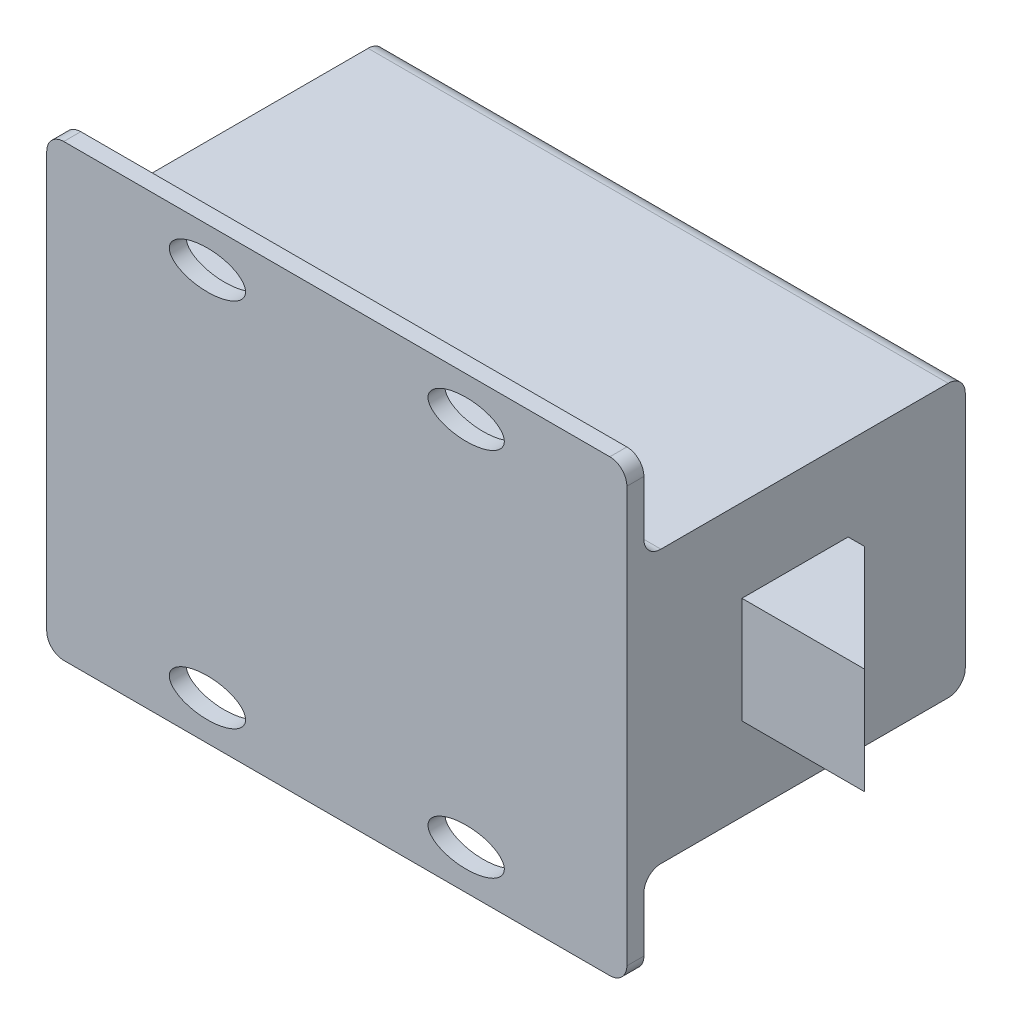
ISO-10303-21;
HEADER;
FILE_DESCRIPTION(('STEP AP214'),'2;1');
FILE_NAME('part.step','',(''),(''),'','','');
FILE_SCHEMA(('AUTOMOTIVE_DESIGN { 1 0 10303 214 1 1 1 1 }'));
ENDSEC;
DATA;
#1=APPLICATION_CONTEXT('core data for automotive mechanical design processes');
#2=APPLICATION_PROTOCOL_DEFINITION('international standard','automotive_design',2000,#1);
#3=PRODUCT_CONTEXT('',#1,'mechanical');
#4=PRODUCT('Part','Part','',(#3));
#5=PRODUCT_RELATED_PRODUCT_CATEGORY('part','',(#4));
#6=PRODUCT_DEFINITION_FORMATION('','',#4);
#7=PRODUCT_DEFINITION_CONTEXT('part definition',#1,'design');
#8=PRODUCT_DEFINITION('design','',#6,#7);
#9=PRODUCT_DEFINITION_SHAPE('','',#8);
#10=(LENGTH_UNIT() NAMED_UNIT(*) SI_UNIT(.MILLI.,.METRE.));
#11=(NAMED_UNIT(*) PLANE_ANGLE_UNIT() SI_UNIT($,.RADIAN.));
#12=(NAMED_UNIT(*) SI_UNIT($,.STERADIAN.) SOLID_ANGLE_UNIT());
#13=UNCERTAINTY_MEASURE_WITH_UNIT(LENGTH_MEASURE(1.E-05),#10,'distance_accuracy_value','');
#14=(GEOMETRIC_REPRESENTATION_CONTEXT(3) GLOBAL_UNCERTAINTY_ASSIGNED_CONTEXT((#13)) GLOBAL_UNIT_ASSIGNED_CONTEXT((#10,
#11,#12)) REPRESENTATION_CONTEXT('',''));
#15=CARTESIAN_POINT('',(0.,0.,0.));
#16=DIRECTION('',(0.,0.,1.));
#17=DIRECTION('',(1.,0.,0.));
#18=AXIS2_PLACEMENT_3D('',#15,#16,#17);
#19=CARTESIAN_POINT('',(27.051,-20.955,1.5875));
#20=DIRECTION('',(-1.,0.,0.));
#21=DIRECTION('',(0.,0.,1.));
#22=AXIS2_PLACEMENT_3D('',#19,#20,#21);
#23=PLANE('',#22);
#24=DIRECTION('',(0.,0.,1.));
#25=VECTOR('',#24,1.);
#26=CARTESIAN_POINT('',(27.051,-12.7,-29.972));
#27=LINE('',#26,#25);
#28=CARTESIAN_POINT('',(27.051,-12.7,-28.3845));
#29=VERTEX_POINT('',#28);
#30=CARTESIAN_POINT('',(27.051,-12.7,-1.5875));
#31=VERTEX_POINT('',#30);
#32=EDGE_CURVE('E421',#29,#31,#27,.T.);
#33=ORIENTED_EDGE('',*,*,#32,.F.);
#34=CARTESIAN_POINT('',(27.051,-11.1125,-28.3845));
#35=DIRECTION('',(-1.,0.,0.));
#36=DIRECTION('',(0.,0.,1.));
#37=AXIS2_PLACEMENT_3D('',#34,#35,#36);
#38=CIRCLE('',#37,1.5875);
#39=CARTESIAN_POINT('',(27.051,-11.1125,-29.972));
#40=VERTEX_POINT('',#39);
#41=EDGE_CURVE('E42',#29,#40,#38,.F.);
#42=ORIENTED_EDGE('',*,*,#41,.T.);
#43=DIRECTION('',(0.,-1.,0.));
#44=VECTOR('',#43,1.);
#45=CARTESIAN_POINT('',(27.051,-12.7,-29.972));
#46=LINE('',#45,#44);
#47=CARTESIAN_POINT('',(27.051,11.1125,-29.972));
#48=VERTEX_POINT('',#47);
#49=EDGE_CURVE('E425',#48,#40,#46,.T.);
#50=ORIENTED_EDGE('',*,*,#49,.F.);
#51=CARTESIAN_POINT('',(27.051,11.1125,-28.3845));
#52=DIRECTION('',(-1.,0.,0.));
#53=DIRECTION('',(0.,0.,1.));
#54=AXIS2_PLACEMENT_3D('',#51,#52,#53);
#55=CIRCLE('',#54,1.5875);
#56=CARTESIAN_POINT('',(27.051,12.7,-28.3845));
#57=VERTEX_POINT('',#56);
#58=EDGE_CURVE('E321',#48,#57,#55,.F.);
#59=ORIENTED_EDGE('',*,*,#58,.T.);
#60=DIRECTION('',(0.,0.,1.));
#61=VECTOR('',#60,1.);
#62=CARTESIAN_POINT('',(27.051,12.7,-29.972));
#63=LINE('',#62,#61);
#64=CARTESIAN_POINT('',(27.051,12.7,-1.5875));
#65=VERTEX_POINT('',#64);
#66=EDGE_CURVE('E419',#57,#65,#63,.T.);
#67=ORIENTED_EDGE('',*,*,#66,.T.);
#68=CARTESIAN_POINT('',(27.051,14.2875,-1.5875));
#69=DIRECTION('',(-1.,0.,0.));
#70=DIRECTION('',(0.,0.,1.));
#71=AXIS2_PLACEMENT_3D('',#68,#69,#70);
#72=CIRCLE('',#71,1.5875);
#73=CARTESIAN_POINT('',(27.051,14.2875,0.));
#74=VERTEX_POINT('',#73);
#75=EDGE_CURVE('E336',#65,#74,#72,.T.);
#76=ORIENTED_EDGE('',*,*,#75,.T.);
#77=DIRECTION('',(0.,1.,0.));
#78=VECTOR('',#77,1.);
#79=CARTESIAN_POINT('',(27.051,-20.955,0.));
#80=LINE('',#79,#78);
#81=CARTESIAN_POINT('',(27.051,19.3675,0.));
#82=VERTEX_POINT('',#81);
#83=EDGE_CURVE('E406',#74,#82,#80,.T.);
#84=ORIENTED_EDGE('',*,*,#83,.T.);
#85=DIRECTION('',(0.,0.,-1.));
#86=VECTOR('',#85,1.);
#87=CARTESIAN_POINT('',(27.051,19.3675,1.5875));
#88=LINE('',#87,#86);
#89=CARTESIAN_POINT('',(27.051,19.3675,1.5875));
#90=VERTEX_POINT('',#89);
#91=EDGE_CURVE('E389',#82,#90,#88,.F.);
#92=ORIENTED_EDGE('',*,*,#91,.T.);
#93=DIRECTION('',(0.,1.,0.));
#94=VECTOR('',#93,1.);
#95=CARTESIAN_POINT('',(27.051,-20.955,1.5875));
#96=LINE('',#95,#94);
#97=CARTESIAN_POINT('',(27.051,-19.3675,1.5875));
#98=VERTEX_POINT('',#97);
#99=EDGE_CURVE('E395',#98,#90,#96,.T.);
#100=ORIENTED_EDGE('',*,*,#99,.F.);
#101=DIRECTION('',(0.,0.,-1.));
#102=VECTOR('',#101,1.);
#103=CARTESIAN_POINT('',(27.051,-19.3675,1.5875));
#104=LINE('',#103,#102);
#105=CARTESIAN_POINT('',(27.051,-19.3675,0.));
#106=VERTEX_POINT('',#105);
#107=EDGE_CURVE('E386',#98,#106,#104,.T.);
#108=ORIENTED_EDGE('',*,*,#107,.T.);
#109=CARTESIAN_POINT('',(27.051,-14.2875,0.));
#110=VERTEX_POINT('',#109);
#111=EDGE_CURVE('E403',#106,#110,#80,.T.);
#112=ORIENTED_EDGE('',*,*,#111,.T.);
#113=CARTESIAN_POINT('',(27.051,-14.2875,-1.5875));
#114=DIRECTION('',(-1.,0.,0.));
#115=DIRECTION('',(0.,0.,1.));
#116=AXIS2_PLACEMENT_3D('',#113,#114,#115);
#117=CIRCLE('',#116,1.5875);
#118=EDGE_CURVE('E338',#110,#31,#117,.T.);
#119=ORIENTED_EDGE('',*,*,#118,.T.);
#120=EDGE_LOOP('',(#33,#42,#50,#59,#67,#76,#84,#92,#100,#108,#112,#119));
#121=FACE_BOUND('',#120,.T.);
#122=DIRECTION('',(0.,0.,1.));
#123=VECTOR('',#122,1.);
#124=CARTESIAN_POINT('',(27.051,4.953,-19.05));
#125=LINE('',#124,#123);
#126=CARTESIAN_POINT('',(27.051,4.953,-19.05));
#127=VERTEX_POINT('',#126);
#128=CARTESIAN_POINT('',(27.051,4.953,-9.144));
#129=VERTEX_POINT('',#128);
#130=EDGE_CURVE('E628',#127,#129,#125,.T.);
#131=ORIENTED_EDGE('',*,*,#130,.F.);
#132=DIRECTION('',(0.,1.,0.));
#133=VECTOR('',#132,1.);
#134=CARTESIAN_POINT('',(27.051,-4.953,-19.05));
#135=LINE('',#134,#133);
#136=CARTESIAN_POINT('',(27.051,-4.953,-19.05));
#137=VERTEX_POINT('',#136);
#138=EDGE_CURVE('E190',#137,#127,#135,.T.);
#139=ORIENTED_EDGE('',*,*,#138,.F.);
#140=DIRECTION('',(0.,0.,1.));
#141=VECTOR('',#140,1.);
#142=CARTESIAN_POINT('',(27.051,-4.953,-19.05));
#143=LINE('',#142,#141);
#144=CARTESIAN_POINT('',(27.051,-4.953,-9.144));
#145=VERTEX_POINT('',#144);
#146=EDGE_CURVE('E54',#137,#145,#143,.T.);
#147=ORIENTED_EDGE('',*,*,#146,.T.);
#148=DIRECTION('',(0.,1.,0.));
#149=VECTOR('',#148,1.);
#150=CARTESIAN_POINT('',(27.051,-4.953,-9.144));
#151=LINE('',#150,#149);
#152=EDGE_CURVE('E49',#145,#129,#151,.T.);
#153=ORIENTED_EDGE('',*,*,#152,.T.);
#154=EDGE_LOOP('',(#131,#139,#147,#153));
#155=FACE_BOUND('',#154,.T.);
#156=ADVANCED_FACE('F34',(#121,#155),#23,.F.);
#157=CARTESIAN_POINT('',(0.,0.,0.));
#158=DIRECTION('',(0.,0.,-1.));
#159=DIRECTION('',(-1.,0.,0.));
#160=AXIS2_PLACEMENT_3D('',#157,#158,#159);
#161=PLANE('',#160);
#162=CARTESIAN_POINT('',(-12.065,-17.2742733538217,0.));
#163=DIRECTION('',(0.,0.,-1.));
#164=DIRECTION('',(-1.,0.,0.));
#165=AXIS2_PLACEMENT_3D('',#162,#163,#164);
#166=ELLIPSE('',#165,3.556,1.778);
#167=CARTESIAN_POINT('',(-15.621,-17.2742733538217,0.));
#168=VERTEX_POINT('',#167);
#169=EDGE_CURVE('E208',#168,#168,#166,.T.);
#170=ORIENTED_EDGE('',*,*,#169,.F.);
#171=EDGE_LOOP('',(#170));
#172=FACE_BOUND('',#171,.T.);
#173=CARTESIAN_POINT('',(12.065,-17.2742733538217,0.));
#174=DIRECTION('',(0.,0.,-1.));
#175=DIRECTION('',(1.,0.,0.));
#176=AXIS2_PLACEMENT_3D('',#173,#174,#175);
#177=ELLIPSE('',#176,3.556,1.778);
#178=CARTESIAN_POINT('',(15.621,-17.2742733538217,0.));
#179=VERTEX_POINT('',#178);
#180=EDGE_CURVE('E207',#179,#179,#177,.T.);
#181=ORIENTED_EDGE('',*,*,#180,.F.);
#182=EDGE_LOOP('',(#181));
#183=FACE_BOUND('',#182,.T.);
#184=DIRECTION('',(0.,-1.,0.));
#185=VECTOR('',#184,1.);
#186=CARTESIAN_POINT('',(-27.051,-20.955,0.));
#187=LINE('',#186,#185);
#188=CARTESIAN_POINT('',(-27.051,-14.2875,0.));
#189=VERTEX_POINT('',#188);
#190=CARTESIAN_POINT('',(-27.051,-19.3675,0.));
#191=VERTEX_POINT('',#190);
#192=EDGE_CURVE('E399',#189,#191,#187,.T.);
#193=ORIENTED_EDGE('',*,*,#192,.F.);
#194=DIRECTION('',(-1.,0.,0.));
#195=VECTOR('',#194,1.);
#196=CARTESIAN_POINT('',(0.,-14.2875,0.));
#197=LINE('',#196,#195);
#198=EDGE_CURVE('E348',#189,#110,#197,.F.);
#199=ORIENTED_EDGE('',*,*,#198,.T.);
#200=ORIENTED_EDGE('',*,*,#111,.F.);
#201=CARTESIAN_POINT('',(25.4635,-19.3675,0.));
#202=DIRECTION('',(0.,0.,-1.));
#203=DIRECTION('',(-1.,0.,0.));
#204=AXIS2_PLACEMENT_3D('',#201,#202,#203);
#205=CIRCLE('',#204,1.5875);
#206=CARTESIAN_POINT('',(25.4635,-20.955,0.));
#207=VERTEX_POINT('',#206);
#208=EDGE_CURVE('E376',#106,#207,#205,.T.);
#209=ORIENTED_EDGE('',*,*,#208,.T.);
#210=DIRECTION('',(1.,0.,0.));
#211=VECTOR('',#210,1.);
#212=CARTESIAN_POINT('',(-27.051,-20.955,0.));
#213=LINE('',#212,#211);
#214=CARTESIAN_POINT('',(-25.4635,-20.955,0.));
#215=VERTEX_POINT('',#214);
#216=EDGE_CURVE('E392',#215,#207,#213,.T.);
#217=ORIENTED_EDGE('',*,*,#216,.F.);
#218=CARTESIAN_POINT('',(-25.4635,-19.3675,0.));
#219=DIRECTION('',(0.,0.,-1.));
#220=DIRECTION('',(-1.,0.,0.));
#221=AXIS2_PLACEMENT_3D('',#218,#219,#220);
#222=CIRCLE('',#221,1.5875);
#223=EDGE_CURVE('E378',#215,#191,#222,.T.);
#224=ORIENTED_EDGE('',*,*,#223,.T.);
#225=EDGE_LOOP('',(#193,#199,#200,#209,#217,#224));
#226=FACE_BOUND('',#225,.T.);
#227=ADVANCED_FACE('F270',(#172,#183,#226),#161,.T.);
#228=CARTESIAN_POINT('',(-27.051,20.955,1.5875));
#229=DIRECTION('',(0.,-1.,0.));
#230=DIRECTION('',(0.,0.,-1.));
#231=AXIS2_PLACEMENT_3D('',#228,#229,#230);
#232=PLANE('',#231);
#233=DIRECTION('',(-1.,0.,0.));
#234=VECTOR('',#233,1.);
#235=CARTESIAN_POINT('',(-27.051,20.955,0.));
#236=LINE('',#235,#234);
#237=CARTESIAN_POINT('',(25.4635,20.955,0.));
#238=VERTEX_POINT('',#237);
#239=CARTESIAN_POINT('',(-25.4635,20.955,0.));
#240=VERTEX_POINT('',#239);
#241=EDGE_CURVE('E400',#238,#240,#236,.T.);
#242=ORIENTED_EDGE('',*,*,#241,.T.);
#243=DIRECTION('',(0.,0.,-1.));
#244=VECTOR('',#243,1.);
#245=CARTESIAN_POINT('',(-25.4635,20.955,1.5875));
#246=LINE('',#245,#244);
#247=CARTESIAN_POINT('',(-25.4635,20.955,1.5875));
#248=VERTEX_POINT('',#247);
#249=EDGE_CURVE('E353',#240,#248,#246,.F.);
#250=ORIENTED_EDGE('',*,*,#249,.T.);
#251=DIRECTION('',(-1.,0.,0.));
#252=VECTOR('',#251,1.);
#253=CARTESIAN_POINT('',(-27.051,20.955,1.5875));
#254=LINE('',#253,#252);
#255=CARTESIAN_POINT('',(25.4635,20.955,1.5875));
#256=VERTEX_POINT('',#255);
#257=EDGE_CURVE('E412',#256,#248,#254,.T.);
#258=ORIENTED_EDGE('',*,*,#257,.F.);
#259=DIRECTION('',(0.,0.,-1.));
#260=VECTOR('',#259,1.);
#261=CARTESIAN_POINT('',(25.4635,20.955,1.5875));
#262=LINE('',#261,#260);
#263=EDGE_CURVE('E355',#256,#238,#262,.T.);
#264=ORIENTED_EDGE('',*,*,#263,.T.);
#265=EDGE_LOOP('',(#242,#250,#258,#264));
#266=FACE_BOUND('',#265,.T.);
#267=ADVANCED_FACE('F277',(#266),#232,.F.);
#268=CARTESIAN_POINT('',(-27.051,-20.955,1.5875));
#269=DIRECTION('',(1.,0.,0.));
#270=DIRECTION('',(0.,0.,-1.));
#271=AXIS2_PLACEMENT_3D('',#268,#269,#270);
#272=PLANE('',#271);
#273=DIRECTION('',(0.,1.,0.));
#274=VECTOR('',#273,1.);
#275=CARTESIAN_POINT('',(-27.051,-12.7,-29.972));
#276=LINE('',#275,#274);
#277=CARTESIAN_POINT('',(-27.051,-11.1125,-29.972));
#278=VERTEX_POINT('',#277);
#279=CARTESIAN_POINT('',(-27.051,11.1125,-29.972));
#280=VERTEX_POINT('',#279);
#281=EDGE_CURVE('E241',#278,#280,#276,.T.);
#282=ORIENTED_EDGE('',*,*,#281,.F.);
#283=CARTESIAN_POINT('',(-27.051,-11.1125,-28.3845));
#284=DIRECTION('',(1.,0.,0.));
#285=DIRECTION('',(0.,0.,-1.));
#286=AXIS2_PLACEMENT_3D('',#283,#284,#285);
#287=CIRCLE('',#286,1.5875);
#288=CARTESIAN_POINT('',(-27.051,-12.7,-28.3845));
#289=VERTEX_POINT('',#288);
#290=EDGE_CURVE('E325',#278,#289,#287,.F.);
#291=ORIENTED_EDGE('',*,*,#290,.T.);
#292=DIRECTION('',(0.,0.,1.));
#293=VECTOR('',#292,1.);
#294=CARTESIAN_POINT('',(-27.051,-12.7,-29.972));
#295=LINE('',#294,#293);
#296=CARTESIAN_POINT('',(-27.051,-12.7,-1.5875));
#297=VERTEX_POINT('',#296);
#298=EDGE_CURVE('E423',#289,#297,#295,.T.);
#299=ORIENTED_EDGE('',*,*,#298,.T.);
#300=CARTESIAN_POINT('',(-27.051,-14.2875,-1.5875));
#301=DIRECTION('',(1.,0.,0.));
#302=DIRECTION('',(0.,0.,-1.));
#303=AXIS2_PLACEMENT_3D('',#300,#301,#302);
#304=CIRCLE('',#303,1.5875);
#305=EDGE_CURVE('E341',#297,#189,#304,.T.);
#306=ORIENTED_EDGE('',*,*,#305,.T.);
#307=ORIENTED_EDGE('',*,*,#192,.T.);
#308=DIRECTION('',(0.,0.,-1.));
#309=VECTOR('',#308,1.);
#310=CARTESIAN_POINT('',(-27.051,-19.3675,1.5875));
#311=LINE('',#310,#309);
#312=CARTESIAN_POINT('',(-27.051,-19.3675,1.5875));
#313=VERTEX_POINT('',#312);
#314=EDGE_CURVE('E358',#191,#313,#311,.F.);
#315=ORIENTED_EDGE('',*,*,#314,.T.);
#316=DIRECTION('',(0.,-1.,0.));
#317=VECTOR('',#316,1.);
#318=CARTESIAN_POINT('',(-27.051,-20.955,1.5875));
#319=LINE('',#318,#317);
#320=CARTESIAN_POINT('',(-27.051,19.3675,1.5875));
#321=VERTEX_POINT('',#320);
#322=EDGE_CURVE('E409',#321,#313,#319,.T.);
#323=ORIENTED_EDGE('',*,*,#322,.F.);
#324=DIRECTION('',(0.,0.,-1.));
#325=VECTOR('',#324,1.);
#326=CARTESIAN_POINT('',(-27.051,19.3675,1.5875));
#327=LINE('',#326,#325);
#328=CARTESIAN_POINT('',(-27.051,19.3675,0.));
#329=VERTEX_POINT('',#328);
#330=EDGE_CURVE('E360',#321,#329,#327,.T.);
#331=ORIENTED_EDGE('',*,*,#330,.T.);
#332=CARTESIAN_POINT('',(-27.051,14.2875,0.));
#333=VERTEX_POINT('',#332);
#334=EDGE_CURVE('E396',#329,#333,#187,.T.);
#335=ORIENTED_EDGE('',*,*,#334,.T.);
#336=CARTESIAN_POINT('',(-27.051,14.2875,-1.5875));
#337=DIRECTION('',(1.,0.,0.));
#338=DIRECTION('',(0.,0.,-1.));
#339=AXIS2_PLACEMENT_3D('',#336,#337,#338);
#340=CIRCLE('',#339,1.5875);
#341=CARTESIAN_POINT('',(-27.051,12.7,-1.5875));
#342=VERTEX_POINT('',#341);
#343=EDGE_CURVE('E333',#333,#342,#340,.T.);
#344=ORIENTED_EDGE('',*,*,#343,.T.);
#345=DIRECTION('',(0.,0.,1.));
#346=VECTOR('',#345,1.);
#347=CARTESIAN_POINT('',(-27.051,12.7,-29.972));
#348=LINE('',#347,#346);
#349=CARTESIAN_POINT('',(-27.051,12.7,-28.3845));
#350=VERTEX_POINT('',#349);
#351=EDGE_CURVE('E417',#350,#342,#348,.T.);
#352=ORIENTED_EDGE('',*,*,#351,.F.);
#353=CARTESIAN_POINT('',(-27.051,11.1125,-28.3845));
#354=DIRECTION('',(1.,0.,0.));
#355=DIRECTION('',(0.,0.,-1.));
#356=AXIS2_PLACEMENT_3D('',#353,#354,#355);
#357=CIRCLE('',#356,1.5875);
#358=EDGE_CURVE('E327',#350,#280,#357,.F.);
#359=ORIENTED_EDGE('',*,*,#358,.T.);
#360=EDGE_LOOP('',(#282,#291,#299,#306,#307,#315,#323,#331,#335,#344,#352,#359));
#361=FACE_BOUND('',#360,.T.);
#362=ADVANCED_FACE('F273',(#361),#272,.F.);
#363=CARTESIAN_POINT('',(-27.051,-20.955,1.5875));
#364=DIRECTION('',(0.,1.,0.));
#365=DIRECTION('',(0.,0.,1.));
#366=AXIS2_PLACEMENT_3D('',#363,#364,#365);
#367=PLANE('',#366);
#368=ORIENTED_EDGE('',*,*,#216,.T.);
#369=DIRECTION('',(0.,0.,-1.));
#370=VECTOR('',#369,1.);
#371=CARTESIAN_POINT('',(25.4635,-20.955,1.5875));
#372=LINE('',#371,#370);
#373=CARTESIAN_POINT('',(25.4635,-20.955,1.5875));
#374=VERTEX_POINT('',#373);
#375=EDGE_CURVE('E371',#207,#374,#372,.F.);
#376=ORIENTED_EDGE('',*,*,#375,.T.);
#377=DIRECTION('',(1.,0.,0.));
#378=VECTOR('',#377,1.);
#379=CARTESIAN_POINT('',(-27.051,-20.955,1.5875));
#380=LINE('',#379,#378);
#381=CARTESIAN_POINT('',(-25.4635,-20.955,1.5875));
#382=VERTEX_POINT('',#381);
#383=EDGE_CURVE('E391',#382,#374,#380,.T.);
#384=ORIENTED_EDGE('',*,*,#383,.F.);
#385=DIRECTION('',(0.,0.,-1.));
#386=VECTOR('',#385,1.);
#387=CARTESIAN_POINT('',(-25.4635,-20.955,1.5875));
#388=LINE('',#387,#386);
#389=EDGE_CURVE('E373',#382,#215,#388,.T.);
#390=ORIENTED_EDGE('',*,*,#389,.T.);
#391=EDGE_LOOP('',(#368,#376,#384,#390));
#392=FACE_BOUND('',#391,.T.);
#393=ADVANCED_FACE('F264',(#392),#367,.F.);
#394=CARTESIAN_POINT('',(0.,0.,1.5875));
#395=DIRECTION('',(0.,0.,-1.));
#396=DIRECTION('',(-1.,0.,0.));
#397=AXIS2_PLACEMENT_3D('',#394,#395,#396);
#398=PLANE('',#397);
#399=CARTESIAN_POINT('',(12.065,17.2742733538217,1.5875));
#400=DIRECTION('',(0.,0.,-1.));
#401=DIRECTION('',(1.,0.,0.));
#402=AXIS2_PLACEMENT_3D('',#399,#400,#401);
#403=ELLIPSE('',#402,3.556,1.778);
#404=CARTESIAN_POINT('',(15.621,17.2742733538217,1.5875));
#405=VERTEX_POINT('',#404);
#406=EDGE_CURVE('E231',#405,#405,#403,.T.);
#407=ORIENTED_EDGE('',*,*,#406,.T.);
#408=EDGE_LOOP('',(#407));
#409=FACE_BOUND('',#408,.T.);
#410=CARTESIAN_POINT('',(-12.065,17.2742733538217,1.5875));
#411=DIRECTION('',(0.,0.,-1.));
#412=DIRECTION('',(-1.,0.,0.));
#413=AXIS2_PLACEMENT_3D('',#410,#411,#412);
#414=ELLIPSE('',#413,3.556,1.778);
#415=CARTESIAN_POINT('',(-15.621,17.2742733538217,1.5875));
#416=VERTEX_POINT('',#415);
#417=EDGE_CURVE('E225',#416,#416,#414,.T.);
#418=ORIENTED_EDGE('',*,*,#417,.T.);
#419=EDGE_LOOP('',(#418));
#420=FACE_BOUND('',#419,.T.);
#421=CARTESIAN_POINT('',(-12.065,-17.2742733538217,1.5875));
#422=DIRECTION('',(0.,0.,-1.));
#423=DIRECTION('',(-1.,0.,0.));
#424=AXIS2_PLACEMENT_3D('',#421,#422,#423);
#425=ELLIPSE('',#424,3.556,1.778);
#426=CARTESIAN_POINT('',(-15.621,-17.2742733538217,1.5875));
#427=VERTEX_POINT('',#426);
#428=EDGE_CURVE('E203',#427,#427,#425,.T.);
#429=ORIENTED_EDGE('',*,*,#428,.T.);
#430=EDGE_LOOP('',(#429));
#431=FACE_BOUND('',#430,.T.);
#432=CARTESIAN_POINT('',(12.065,-17.2742733538217,1.5875));
#433=DIRECTION('',(0.,0.,-1.));
#434=DIRECTION('',(1.,0.,0.));
#435=AXIS2_PLACEMENT_3D('',#432,#433,#434);
#436=ELLIPSE('',#435,3.556,1.778);
#437=CARTESIAN_POINT('',(15.621,-17.2742733538217,1.5875));
#438=VERTEX_POINT('',#437);
#439=EDGE_CURVE('E237',#438,#438,#436,.T.);
#440=ORIENTED_EDGE('',*,*,#439,.T.);
#441=EDGE_LOOP('',(#440));
#442=FACE_BOUND('',#441,.T.);
#443=ORIENTED_EDGE('',*,*,#383,.T.);
#444=CARTESIAN_POINT('',(25.4635,-19.3675,1.5875));
#445=DIRECTION('',(0.,0.,-1.));
#446=DIRECTION('',(-1.,0.,0.));
#447=AXIS2_PLACEMENT_3D('',#444,#445,#446);
#448=CIRCLE('',#447,1.5875);
#449=EDGE_CURVE('E363',#374,#98,#448,.F.);
#450=ORIENTED_EDGE('',*,*,#449,.T.);
#451=ORIENTED_EDGE('',*,*,#99,.T.);
#452=CARTESIAN_POINT('',(25.4635,19.3675,1.5875));
#453=DIRECTION('',(0.,0.,-1.));
#454=DIRECTION('',(-1.,0.,0.));
#455=AXIS2_PLACEMENT_3D('',#452,#453,#454);
#456=CIRCLE('',#455,1.5875);
#457=EDGE_CURVE('E369',#90,#256,#456,.F.);
#458=ORIENTED_EDGE('',*,*,#457,.T.);
#459=ORIENTED_EDGE('',*,*,#257,.T.);
#460=CARTESIAN_POINT('',(-25.4635,19.3675,1.5875));
#461=DIRECTION('',(0.,0.,-1.));
#462=DIRECTION('',(-1.,0.,0.));
#463=AXIS2_PLACEMENT_3D('',#460,#461,#462);
#464=CIRCLE('',#463,1.5875);
#465=EDGE_CURVE('E367',#248,#321,#464,.F.);
#466=ORIENTED_EDGE('',*,*,#465,.T.);
#467=ORIENTED_EDGE('',*,*,#322,.T.);
#468=CARTESIAN_POINT('',(-25.4635,-19.3675,1.5875));
#469=DIRECTION('',(0.,0.,-1.));
#470=DIRECTION('',(-1.,0.,0.));
#471=AXIS2_PLACEMENT_3D('',#468,#469,#470);
#472=CIRCLE('',#471,1.5875);
#473=EDGE_CURVE('E365',#313,#382,#472,.F.);
#474=ORIENTED_EDGE('',*,*,#473,.T.);
#475=EDGE_LOOP('',(#443,#450,#451,#458,#459,#466,#467,#474));
#476=FACE_BOUND('',#475,.T.);
#477=ADVANCED_FACE('F260',(#409,#420,#431,#442,#476),#398,.F.);
#478=CARTESIAN_POINT('',(12.065,17.2742733538217,0.));
#479=DIRECTION('',(0.,0.,-1.));
#480=DIRECTION('',(1.,0.,0.));
#481=AXIS2_PLACEMENT_3D('',#478,#479,#480);
#482=ELLIPSE('',#481,3.556,1.778);
#483=CARTESIAN_POINT('',(15.621,17.2742733538217,0.));
#484=VERTEX_POINT('',#483);
#485=EDGE_CURVE('E202',#484,#484,#482,.T.);
#486=ORIENTED_EDGE('',*,*,#485,.F.);
#487=EDGE_LOOP('',(#486));
#488=FACE_BOUND('',#487,.T.);
#489=CARTESIAN_POINT('',(-12.065,17.2742733538217,0.));
#490=DIRECTION('',(0.,0.,-1.));
#491=DIRECTION('',(-1.,0.,0.));
#492=AXIS2_PLACEMENT_3D('',#489,#490,#491);
#493=ELLIPSE('',#492,3.556,1.778);
#494=CARTESIAN_POINT('',(-15.621,17.2742733538217,0.));
#495=VERTEX_POINT('',#494);
#496=EDGE_CURVE('E229',#495,#495,#493,.T.);
#497=ORIENTED_EDGE('',*,*,#496,.F.);
#498=EDGE_LOOP('',(#497));
#499=FACE_BOUND('',#498,.T.);
#500=ORIENTED_EDGE('',*,*,#83,.F.);
#501=DIRECTION('',(1.,0.,0.));
#502=VECTOR('',#501,1.);
#503=CARTESIAN_POINT('',(0.,14.2875,0.));
#504=LINE('',#503,#502);
#505=EDGE_CURVE('E343',#74,#333,#504,.F.);
#506=ORIENTED_EDGE('',*,*,#505,.T.);
#507=ORIENTED_EDGE('',*,*,#334,.F.);
#508=CARTESIAN_POINT('',(-25.4635,19.3675,0.));
#509=DIRECTION('',(0.,0.,-1.));
#510=DIRECTION('',(-1.,0.,0.));
#511=AXIS2_PLACEMENT_3D('',#508,#509,#510);
#512=CIRCLE('',#511,1.5875);
#513=EDGE_CURVE('E381',#329,#240,#512,.T.);
#514=ORIENTED_EDGE('',*,*,#513,.T.);
#515=ORIENTED_EDGE('',*,*,#241,.F.);
#516=CARTESIAN_POINT('',(25.4635,19.3675,0.));
#517=DIRECTION('',(0.,0.,-1.));
#518=DIRECTION('',(-1.,0.,0.));
#519=AXIS2_PLACEMENT_3D('',#516,#517,#518);
#520=CIRCLE('',#519,1.5875);
#521=EDGE_CURVE('E383',#238,#82,#520,.T.);
#522=ORIENTED_EDGE('',*,*,#521,.T.);
#523=EDGE_LOOP('',(#500,#506,#507,#514,#515,#522));
#524=FACE_BOUND('',#523,.T.);
#525=ADVANCED_FACE('F263',(#488,#499,#524),#161,.T.);
#526=CARTESIAN_POINT('',(25.4635,-19.3675,1.5875));
#527=DIRECTION('',(0.,0.,-1.));
#528=DIRECTION('',(-1.,0.,0.));
#529=AXIS2_PLACEMENT_3D('',#526,#527,#528);
#530=CYLINDRICAL_SURFACE('',#529,1.5875);
#531=ORIENTED_EDGE('',*,*,#449,.F.);
#532=ORIENTED_EDGE('',*,*,#375,.F.);
#533=ORIENTED_EDGE('',*,*,#208,.F.);
#534=ORIENTED_EDGE('',*,*,#107,.F.);
#535=EDGE_LOOP('',(#531,#532,#533,#534));
#536=FACE_BOUND('',#535,.T.);
#537=ADVANCED_FACE('F268',(#536),#530,.T.);
#538=CARTESIAN_POINT('',(-25.4635,-19.3675,1.5875));
#539=DIRECTION('',(0.,0.,-1.));
#540=DIRECTION('',(-1.,0.,0.));
#541=AXIS2_PLACEMENT_3D('',#538,#539,#540);
#542=CYLINDRICAL_SURFACE('',#541,1.5875);
#543=ORIENTED_EDGE('',*,*,#473,.F.);
#544=ORIENTED_EDGE('',*,*,#314,.F.);
#545=ORIENTED_EDGE('',*,*,#223,.F.);
#546=ORIENTED_EDGE('',*,*,#389,.F.);
#547=EDGE_LOOP('',(#543,#544,#545,#546));
#548=FACE_BOUND('',#547,.T.);
#549=ADVANCED_FACE('F287',(#548),#542,.T.);
#550=CARTESIAN_POINT('',(-25.4635,19.3675,1.5875));
#551=DIRECTION('',(0.,0.,-1.));
#552=DIRECTION('',(-1.,0.,0.));
#553=AXIS2_PLACEMENT_3D('',#550,#551,#552);
#554=CYLINDRICAL_SURFACE('',#553,1.5875);
#555=ORIENTED_EDGE('',*,*,#465,.F.);
#556=ORIENTED_EDGE('',*,*,#249,.F.);
#557=ORIENTED_EDGE('',*,*,#513,.F.);
#558=ORIENTED_EDGE('',*,*,#330,.F.);
#559=EDGE_LOOP('',(#555,#556,#557,#558));
#560=FACE_BOUND('',#559,.T.);
#561=ADVANCED_FACE('F291',(#560),#554,.T.);
#562=CARTESIAN_POINT('',(25.4635,19.3675,1.5875));
#563=DIRECTION('',(0.,0.,-1.));
#564=DIRECTION('',(-1.,0.,0.));
#565=AXIS2_PLACEMENT_3D('',#562,#563,#564);
#566=CYLINDRICAL_SURFACE('',#565,1.5875);
#567=ORIENTED_EDGE('',*,*,#457,.F.);
#568=ORIENTED_EDGE('',*,*,#91,.F.);
#569=ORIENTED_EDGE('',*,*,#521,.F.);
#570=ORIENTED_EDGE('',*,*,#263,.F.);
#571=EDGE_LOOP('',(#567,#568,#569,#570));
#572=FACE_BOUND('',#571,.T.);
#573=ADVANCED_FACE('F258',(#572),#566,.T.);
#574=CARTESIAN_POINT('',(27.051,12.7,-29.972));
#575=DIRECTION('',(0.,-1.,0.));
#576=DIRECTION('',(0.,0.,-1.));
#577=AXIS2_PLACEMENT_3D('',#574,#575,#576);
#578=PLANE('',#577);
#579=ORIENTED_EDGE('',*,*,#66,.F.);
#580=DIRECTION('',(1.,0.,0.));
#581=VECTOR('',#580,1.);
#582=CARTESIAN_POINT('',(27.051,12.7,-28.3845));
#583=LINE('',#582,#581);
#584=EDGE_CURVE('E11',#57,#350,#583,.F.);
#585=ORIENTED_EDGE('',*,*,#584,.T.);
#586=ORIENTED_EDGE('',*,*,#351,.T.);
#587=DIRECTION('',(1.,0.,0.));
#588=VECTOR('',#587,1.);
#589=CARTESIAN_POINT('',(27.051,12.7,-1.5875));
#590=LINE('',#589,#588);
#591=EDGE_CURVE('E345',#342,#65,#590,.T.);
#592=ORIENTED_EDGE('',*,*,#591,.T.);
#593=EDGE_LOOP('',(#579,#585,#586,#592));
#594=FACE_BOUND('',#593,.T.);
#595=ADVANCED_FACE('F254',(#594),#578,.F.);
#596=CARTESIAN_POINT('',(27.051,-12.7,-29.972));
#597=DIRECTION('',(0.,1.,0.));
#598=DIRECTION('',(0.,0.,1.));
#599=AXIS2_PLACEMENT_3D('',#596,#597,#598);
#600=PLANE('',#599);
#601=ORIENTED_EDGE('',*,*,#298,.F.);
#602=DIRECTION('',(-1.,0.,0.));
#603=VECTOR('',#602,1.);
#604=CARTESIAN_POINT('',(27.051,-12.7,-28.3845));
#605=LINE('',#604,#603);
#606=EDGE_CURVE('E315',#289,#29,#605,.F.);
#607=ORIENTED_EDGE('',*,*,#606,.T.);
#608=ORIENTED_EDGE('',*,*,#32,.T.);
#609=DIRECTION('',(-1.,0.,0.));
#610=VECTOR('',#609,1.);
#611=CARTESIAN_POINT('',(27.051,-12.7,-1.5875));
#612=LINE('',#611,#610);
#613=EDGE_CURVE('E350',#31,#297,#612,.T.);
#614=ORIENTED_EDGE('',*,*,#613,.T.);
#615=EDGE_LOOP('',(#601,#607,#608,#614));
#616=FACE_BOUND('',#615,.T.);
#617=ADVANCED_FACE('F250',(#616),#600,.F.);
#618=CARTESIAN_POINT('',(0.,0.,-29.972));
#619=DIRECTION('',(0.,0.,1.));
#620=DIRECTION('',(1.,0.,0.));
#621=AXIS2_PLACEMENT_3D('',#618,#619,#620);
#622=PLANE('',#621);
#623=ORIENTED_EDGE('',*,*,#49,.T.);
#624=DIRECTION('',(-1.,0.,0.));
#625=VECTOR('',#624,1.);
#626=CARTESIAN_POINT('',(0.,-11.1125,-29.972));
#627=LINE('',#626,#625);
#628=EDGE_CURVE('E317',#40,#278,#627,.T.);
#629=ORIENTED_EDGE('',*,*,#628,.T.);
#630=ORIENTED_EDGE('',*,*,#281,.T.);
#631=DIRECTION('',(1.,0.,0.));
#632=VECTOR('',#631,1.);
#633=CARTESIAN_POINT('',(0.,11.1125,-29.972));
#634=LINE('',#633,#632);
#635=EDGE_CURVE('E330',#280,#48,#634,.T.);
#636=ORIENTED_EDGE('',*,*,#635,.T.);
#637=EDGE_LOOP('',(#623,#629,#630,#636));
#638=FACE_BOUND('',#637,.T.);
#639=ADVANCED_FACE('F246',(#638),#622,.F.);
#640=CARTESIAN_POINT('',(27.051,-14.2875,-1.5875));
#641=DIRECTION('',(-1.,0.,0.));
#642=DIRECTION('',(0.,0.,1.));
#643=AXIS2_PLACEMENT_3D('',#640,#641,#642);
#644=CYLINDRICAL_SURFACE('',#643,1.5875);
#645=ORIENTED_EDGE('',*,*,#118,.F.);
#646=ORIENTED_EDGE('',*,*,#198,.F.);
#647=ORIENTED_EDGE('',*,*,#305,.F.);
#648=ORIENTED_EDGE('',*,*,#613,.F.);
#649=EDGE_LOOP('',(#645,#646,#647,#648));
#650=FACE_BOUND('',#649,.T.);
#651=ADVANCED_FACE('F249',(#650),#644,.F.);
#652=CARTESIAN_POINT('',(27.051,14.2875,-1.5875));
#653=DIRECTION('',(1.,0.,0.));
#654=DIRECTION('',(0.,0.,-1.));
#655=AXIS2_PLACEMENT_3D('',#652,#653,#654);
#656=CYLINDRICAL_SURFACE('',#655,1.5875);
#657=ORIENTED_EDGE('',*,*,#343,.F.);
#658=ORIENTED_EDGE('',*,*,#505,.F.);
#659=ORIENTED_EDGE('',*,*,#75,.F.);
#660=ORIENTED_EDGE('',*,*,#591,.F.);
#661=EDGE_LOOP('',(#657,#658,#659,#660));
#662=FACE_BOUND('',#661,.T.);
#663=ADVANCED_FACE('F301',(#662),#656,.F.);
#664=CARTESIAN_POINT('',(0.,-11.1125,-28.3845));
#665=DIRECTION('',(-1.,0.,0.));
#666=DIRECTION('',(0.,0.,1.));
#667=AXIS2_PLACEMENT_3D('',#664,#665,#666);
#668=CYLINDRICAL_SURFACE('',#667,1.5875);
#669=ORIENTED_EDGE('',*,*,#41,.F.);
#670=ORIENTED_EDGE('',*,*,#606,.F.);
#671=ORIENTED_EDGE('',*,*,#290,.F.);
#672=ORIENTED_EDGE('',*,*,#628,.F.);
#673=EDGE_LOOP('',(#669,#670,#671,#672));
#674=FACE_BOUND('',#673,.T.);
#675=ADVANCED_FACE('F304',(#674),#668,.T.);
#676=CARTESIAN_POINT('',(0.,11.1125,-28.3845));
#677=DIRECTION('',(1.,0.,0.));
#678=DIRECTION('',(0.,0.,-1.));
#679=AXIS2_PLACEMENT_3D('',#676,#677,#678);
#680=CYLINDRICAL_SURFACE('',#679,1.5875);
#681=ORIENTED_EDGE('',*,*,#358,.F.);
#682=ORIENTED_EDGE('',*,*,#584,.F.);
#683=ORIENTED_EDGE('',*,*,#58,.F.);
#684=ORIENTED_EDGE('',*,*,#635,.F.);
#685=EDGE_LOOP('',(#681,#682,#683,#684));
#686=FACE_BOUND('',#685,.T.);
#687=ADVANCED_FACE('F36',(#686),#680,.T.);
#688=DIRECTION('',(0.,0.,-1.));
#689=VECTOR('',#688,1.);
#690=SURFACE_OF_LINEAR_EXTRUSION('',#414,#689);
#691=ORIENTED_EDGE('',*,*,#417,.F.);
#692=EDGE_LOOP('',(#691));
#693=FACE_BOUND('',#692,.T.);
#694=ORIENTED_EDGE('',*,*,#496,.T.);
#695=EDGE_LOOP('',(#694));
#696=FACE_BOUND('',#695,.T.);
#697=ADVANCED_FACE('F218',(#693,#696),#690,.F.);
#698=DIRECTION('',(0.,0.,-1.));
#699=VECTOR('',#698,1.);
#700=SURFACE_OF_LINEAR_EXTRUSION('',#403,#699);
#701=ORIENTED_EDGE('',*,*,#406,.F.);
#702=EDGE_LOOP('',(#701));
#703=FACE_BOUND('',#702,.T.);
#704=ORIENTED_EDGE('',*,*,#485,.T.);
#705=EDGE_LOOP('',(#704));
#706=FACE_BOUND('',#705,.T.);
#707=ADVANCED_FACE('F221',(#703,#706),#700,.F.);
#708=DIRECTION('',(0.,0.,-1.));
#709=VECTOR('',#708,1.);
#710=SURFACE_OF_LINEAR_EXTRUSION('',#436,#709);
#711=ORIENTED_EDGE('',*,*,#439,.F.);
#712=EDGE_LOOP('',(#711));
#713=FACE_BOUND('',#712,.T.);
#714=ORIENTED_EDGE('',*,*,#180,.T.);
#715=EDGE_LOOP('',(#714));
#716=FACE_BOUND('',#715,.T.);
#717=ADVANCED_FACE('F215',(#713,#716),#710,.F.);
#718=DIRECTION('',(0.,0.,-1.));
#719=VECTOR('',#718,1.);
#720=SURFACE_OF_LINEAR_EXTRUSION('',#425,#719);
#721=ORIENTED_EDGE('',*,*,#428,.F.);
#722=EDGE_LOOP('',(#721));
#723=FACE_BOUND('',#722,.T.);
#724=ORIENTED_EDGE('',*,*,#169,.T.);
#725=EDGE_LOOP('',(#724));
#726=FACE_BOUND('',#725,.T.);
#727=ADVANCED_FACE('F211',(#723,#726),#720,.F.);
#728=CARTESIAN_POINT('',(38.481,4.953,-19.05));
#729=DIRECTION('',(0.,-1.,0.));
#730=DIRECTION('',(0.,0.,-1.));
#731=AXIS2_PLACEMENT_3D('',#728,#729,#730);
#732=PLANE('',#731);
#733=DIRECTION('',(-1.,0.,0.));
#734=VECTOR('',#733,1.);
#735=CARTESIAN_POINT('',(38.481,4.953,-9.144));
#736=LINE('',#735,#734);
#737=CARTESIAN_POINT('',(38.481,4.953,-9.144));
#738=VERTEX_POINT('',#737);
#739=EDGE_CURVE('E185',#738,#129,#736,.T.);
#740=ORIENTED_EDGE('',*,*,#739,.F.);
#741=DIRECTION('',(0.707106781186544,0.,0.707106781186551));
#742=VECTOR('',#741,1.);
#743=CARTESIAN_POINT('',(38.481,4.953,-9.144));
#744=LINE('',#743,#742);
#745=CARTESIAN_POINT('',(28.5750000000001,4.953,-19.05));
#746=VERTEX_POINT('',#745);
#747=EDGE_CURVE('E173',#746,#738,#744,.T.);
#748=ORIENTED_EDGE('',*,*,#747,.F.);
#749=DIRECTION('',(-1.,0.,0.));
#750=VECTOR('',#749,1.);
#751=CARTESIAN_POINT('',(38.481,4.953,-19.05));
#752=LINE('',#751,#750);
#753=EDGE_CURVE('E184',#746,#127,#752,.T.);
#754=ORIENTED_EDGE('',*,*,#753,.T.);
#755=ORIENTED_EDGE('',*,*,#130,.T.);
#756=EDGE_LOOP('',(#740,#748,#754,#755));
#757=FACE_BOUND('',#756,.T.);
#758=ADVANCED_FACE('F182',(#757),#732,.F.);
#759=CARTESIAN_POINT('',(38.481,-4.953,-9.144));
#760=DIRECTION('',(0.,0.,1.));
#761=DIRECTION('',(1.,0.,0.));
#762=AXIS2_PLACEMENT_3D('',#759,#760,#761);
#763=PLANE('',#762);
#764=ORIENTED_EDGE('',*,*,#152,.F.);
#765=DIRECTION('',(-1.,0.,0.));
#766=VECTOR('',#765,1.);
#767=CARTESIAN_POINT('',(38.481,-4.953,-9.144));
#768=LINE('',#767,#766);
#769=CARTESIAN_POINT('',(38.481,-4.953,-9.144));
#770=VERTEX_POINT('',#769);
#771=EDGE_CURVE('E194',#770,#145,#768,.T.);
#772=ORIENTED_EDGE('',*,*,#771,.F.);
#773=DIRECTION('',(0.,1.,0.));
#774=VECTOR('',#773,1.);
#775=CARTESIAN_POINT('',(38.481,-4.953,-9.144));
#776=LINE('',#775,#774);
#777=EDGE_CURVE('E192',#770,#738,#776,.T.);
#778=ORIENTED_EDGE('',*,*,#777,.T.);
#779=ORIENTED_EDGE('',*,*,#739,.T.);
#780=EDGE_LOOP('',(#764,#772,#778,#779));
#781=FACE_BOUND('',#780,.T.);
#782=ADVANCED_FACE('F586',(#781),#763,.T.);
#783=CARTESIAN_POINT('',(38.481,-4.953,-19.05));
#784=DIRECTION('',(0.,-1.,0.));
#785=DIRECTION('',(0.,0.,-1.));
#786=AXIS2_PLACEMENT_3D('',#783,#784,#785);
#787=PLANE('',#786);
#788=DIRECTION('',(-0.707106781186544,0.,-0.707106781186551));
#789=VECTOR('',#788,1.);
#790=CARTESIAN_POINT('',(33.528,-4.953,-14.097));
#791=LINE('',#790,#789);
#792=CARTESIAN_POINT('',(28.5750000000001,-4.953,-19.05));
#793=VERTEX_POINT('',#792);
#794=EDGE_CURVE('E176',#770,#793,#791,.T.);
#795=ORIENTED_EDGE('',*,*,#794,.F.);
#796=ORIENTED_EDGE('',*,*,#771,.T.);
#797=ORIENTED_EDGE('',*,*,#146,.F.);
#798=DIRECTION('',(-1.,0.,0.));
#799=VECTOR('',#798,1.);
#800=CARTESIAN_POINT('',(38.481,-4.953,-19.05));
#801=LINE('',#800,#799);
#802=EDGE_CURVE('E191',#793,#137,#801,.T.);
#803=ORIENTED_EDGE('',*,*,#802,.F.);
#804=EDGE_LOOP('',(#795,#796,#797,#803));
#805=FACE_BOUND('',#804,.T.);
#806=ADVANCED_FACE('F593',(#805),#787,.T.);
#807=CARTESIAN_POINT('',(38.481,-4.953,-19.05));
#808=DIRECTION('',(0.,0.,1.));
#809=DIRECTION('',(1.,0.,0.));
#810=AXIS2_PLACEMENT_3D('',#807,#808,#809);
#811=PLANE('',#810);
#812=ORIENTED_EDGE('',*,*,#753,.F.);
#813=DIRECTION('',(0.,1.,0.));
#814=VECTOR('',#813,1.);
#815=CARTESIAN_POINT('',(28.5750000000001,-20.955,-19.05));
#816=LINE('',#815,#814);
#817=EDGE_CURVE('E170',#793,#746,#816,.T.);
#818=ORIENTED_EDGE('',*,*,#817,.F.);
#819=ORIENTED_EDGE('',*,*,#802,.T.);
#820=ORIENTED_EDGE('',*,*,#138,.T.);
#821=EDGE_LOOP('',(#812,#818,#819,#820));
#822=FACE_BOUND('',#821,.T.);
#823=ADVANCED_FACE('F189',(#822),#811,.F.);
#824=CARTESIAN_POINT('',(38.481,-20.955,-9.144));
#825=DIRECTION('',(-0.707106781186551,0.,0.707106781186544));
#826=DIRECTION('',(0.707106781186544,0.,0.707106781186551));
#827=AXIS2_PLACEMENT_3D('',#824,#825,#826);
#828=PLANE('',#827);
#829=ORIENTED_EDGE('',*,*,#794,.T.);
#830=ORIENTED_EDGE('',*,*,#817,.T.);
#831=ORIENTED_EDGE('',*,*,#747,.T.);
#832=ORIENTED_EDGE('',*,*,#777,.F.);
#833=EDGE_LOOP('',(#829,#830,#831,#832));
#834=FACE_BOUND('',#833,.T.);
#835=ADVANCED_FACE('F172',(#834),#828,.F.);
#836=CLOSED_SHELL('',(#156,#227,#267,#362,#393,#477,#525,#537,#549,#561,#573,#595,#617,#639,
#651,#663,#675,#687,#697,#707,#717,#727,#758,#782,#806,#823,#835));
#837=MANIFOLD_SOLID_BREP('B2',#836);
#838=ADVANCED_BREP_SHAPE_REPRESENTATION('',(#18,#837),#14);
#839=SHAPE_DEFINITION_REPRESENTATION(#9,#838);
ENDSEC;
END-ISO-10303-21;
